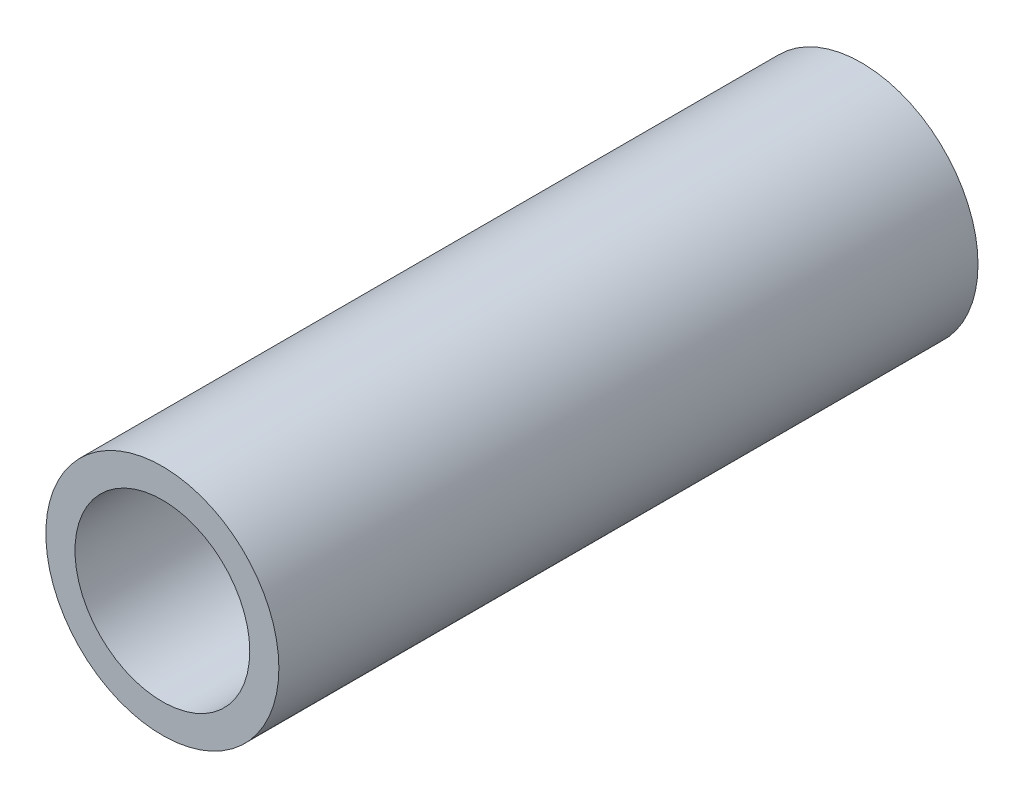
ISO-10303-21;
HEADER;
FILE_DESCRIPTION(('STEP AP214'),'2;1');
FILE_NAME('part.step','',(''),(''),'','','');
FILE_SCHEMA(('AUTOMOTIVE_DESIGN { 1 0 10303 214 1 1 1 1 }'));
ENDSEC;
DATA;
#1=APPLICATION_CONTEXT('core data for automotive mechanical design processes');
#2=APPLICATION_PROTOCOL_DEFINITION('international standard','automotive_design',2000,#1);
#3=PRODUCT_CONTEXT('',#1,'mechanical');
#4=PRODUCT('Part','Part','',(#3));
#5=PRODUCT_RELATED_PRODUCT_CATEGORY('part','',(#4));
#6=PRODUCT_DEFINITION_FORMATION('','',#4);
#7=PRODUCT_DEFINITION_CONTEXT('part definition',#1,'design');
#8=PRODUCT_DEFINITION('design','',#6,#7);
#9=PRODUCT_DEFINITION_SHAPE('','',#8);
#10=(LENGTH_UNIT() NAMED_UNIT(*) SI_UNIT(.MILLI.,.METRE.));
#11=(NAMED_UNIT(*) PLANE_ANGLE_UNIT() SI_UNIT($,.RADIAN.));
#12=(NAMED_UNIT(*) SI_UNIT($,.STERADIAN.) SOLID_ANGLE_UNIT());
#13=UNCERTAINTY_MEASURE_WITH_UNIT(LENGTH_MEASURE(1.E-05),#10,'distance_accuracy_value','');
#14=(GEOMETRIC_REPRESENTATION_CONTEXT(3) GLOBAL_UNCERTAINTY_ASSIGNED_CONTEXT((#13)) GLOBAL_UNIT_ASSIGNED_CONTEXT((#10,
#11,#12)) REPRESENTATION_CONTEXT('',''));
#15=CARTESIAN_POINT('',(0.,0.,0.));
#16=DIRECTION('',(0.,0.,1.));
#17=DIRECTION('',(1.,0.,0.));
#18=AXIS2_PLACEMENT_3D('',#15,#16,#17);
#19=CARTESIAN_POINT('',(0.,0.,120.));
#20=DIRECTION('',(0.,0.,1.));
#21=DIRECTION('',(1.,0.,0.));
#22=AXIS2_PLACEMENT_3D('',#19,#20,#21);
#23=PLANE('',#22);
#24=CARTESIAN_POINT('',(0.,0.,120.));
#25=DIRECTION('',(0.,0.,1.));
#26=DIRECTION('',(1.,0.,0.));
#27=AXIS2_PLACEMENT_3D('',#24,#25,#26);
#28=CIRCLE('',#27,20.);
#29=CARTESIAN_POINT('',(20.,0.,120.));
#30=VERTEX_POINT('',#29);
#31=EDGE_CURVE('E10',#30,#30,#28,.T.);
#32=ORIENTED_EDGE('',*,*,#31,.T.);
#33=EDGE_LOOP('',(#32));
#34=FACE_BOUND('',#33,.T.);
#35=CARTESIAN_POINT('',(0.,0.,120.));
#36=DIRECTION('',(0.,0.,1.));
#37=DIRECTION('',(1.,0.,0.));
#38=AXIS2_PLACEMENT_3D('',#35,#36,#37);
#39=CIRCLE('',#38,15.);
#40=CARTESIAN_POINT('',(15.,0.,120.));
#41=VERTEX_POINT('',#40);
#42=EDGE_CURVE('E42',#41,#41,#39,.T.);
#43=ORIENTED_EDGE('',*,*,#42,.F.);
#44=EDGE_LOOP('',(#43));
#45=FACE_BOUND('',#44,.T.);
#46=ADVANCED_FACE('F31',(#34,#45),#23,.T.);
#47=CARTESIAN_POINT('',(0.,0.,0.));
#48=DIRECTION('',(0.,0.,1.));
#49=DIRECTION('',(1.,0.,0.));
#50=AXIS2_PLACEMENT_3D('',#47,#48,#49);
#51=PLANE('',#50);
#52=CARTESIAN_POINT('',(0.,0.,0.));
#53=DIRECTION('',(0.,0.,1.));
#54=DIRECTION('',(1.,0.,0.));
#55=AXIS2_PLACEMENT_3D('',#52,#53,#54);
#56=CIRCLE('',#55,20.);
#57=CARTESIAN_POINT('',(20.,0.,0.));
#58=VERTEX_POINT('',#57);
#59=EDGE_CURVE('E35',#58,#58,#56,.T.);
#60=ORIENTED_EDGE('',*,*,#59,.F.);
#61=EDGE_LOOP('',(#60));
#62=FACE_BOUND('',#61,.T.);
#63=CARTESIAN_POINT('',(0.,0.,0.));
#64=DIRECTION('',(0.,0.,1.));
#65=DIRECTION('',(1.,0.,0.));
#66=AXIS2_PLACEMENT_3D('',#63,#64,#65);
#67=CIRCLE('',#66,15.);
#68=CARTESIAN_POINT('',(15.,0.,0.));
#69=VERTEX_POINT('',#68);
#70=EDGE_CURVE('E44',#69,#69,#67,.T.);
#71=ORIENTED_EDGE('',*,*,#70,.T.);
#72=EDGE_LOOP('',(#71));
#73=FACE_BOUND('',#72,.T.);
#74=ADVANCED_FACE('F54',(#62,#73),#51,.F.);
#75=CARTESIAN_POINT('',(0.,0.,120.));
#76=DIRECTION('',(0.,0.,-1.));
#77=DIRECTION('',(-1.,0.,0.));
#78=AXIS2_PLACEMENT_3D('',#75,#76,#77);
#79=CYLINDRICAL_SURFACE('',#78,20.);
#80=ORIENTED_EDGE('',*,*,#31,.F.);
#81=EDGE_LOOP('',(#80));
#82=FACE_BOUND('',#81,.T.);
#83=ORIENTED_EDGE('',*,*,#59,.T.);
#84=EDGE_LOOP('',(#83));
#85=FACE_BOUND('',#84,.T.);
#86=ADVANCED_FACE('F33',(#82,#85),#79,.T.);
#87=CARTESIAN_POINT('',(0.,0.,120.));
#88=DIRECTION('',(0.,0.,-1.));
#89=DIRECTION('',(-1.,0.,0.));
#90=AXIS2_PLACEMENT_3D('',#87,#88,#89);
#91=CYLINDRICAL_SURFACE('',#90,15.);
#92=ORIENTED_EDGE('',*,*,#42,.T.);
#93=EDGE_LOOP('',(#92));
#94=FACE_BOUND('',#93,.T.);
#95=ORIENTED_EDGE('',*,*,#70,.F.);
#96=EDGE_LOOP('',(#95));
#97=FACE_BOUND('',#96,.T.);
#98=ADVANCED_FACE('F50',(#94,#97),#91,.F.);
#99=CLOSED_SHELL('',(#46,#74,#86,#98));
#100=MANIFOLD_SOLID_BREP('B2',#99);
#101=ADVANCED_BREP_SHAPE_REPRESENTATION('',(#18,#100),#14);
#102=SHAPE_DEFINITION_REPRESENTATION(#9,#101);
ENDSEC;
END-ISO-10303-21;
